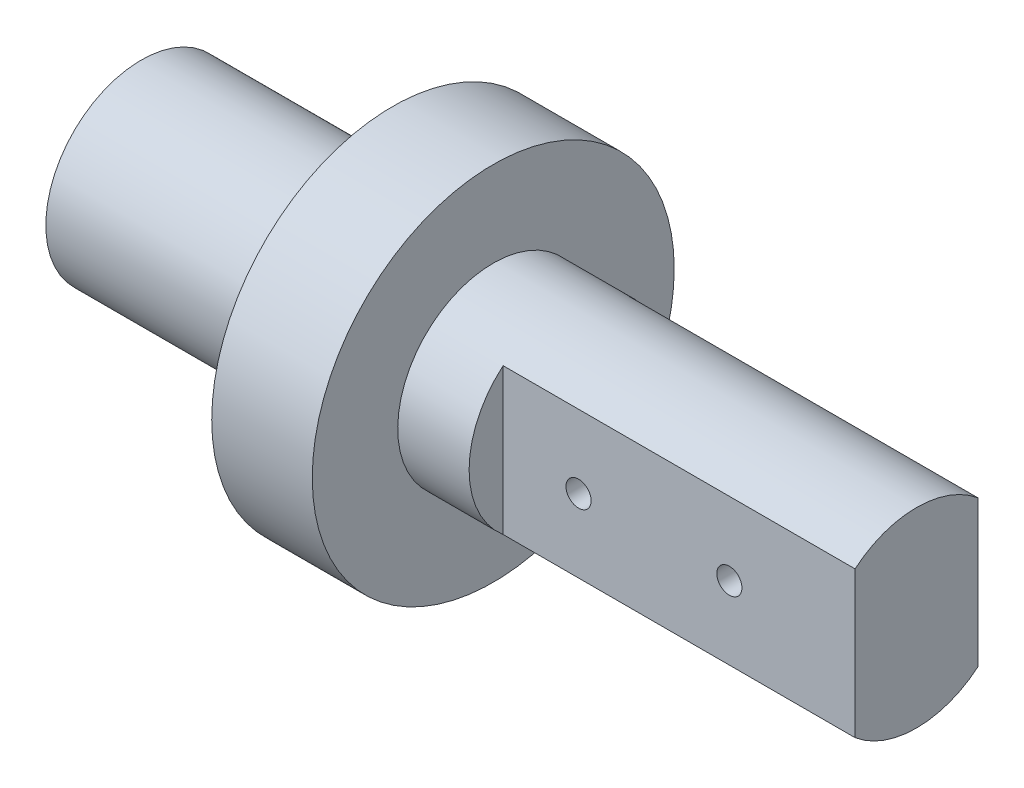
ISO-10303-21;
HEADER;
FILE_DESCRIPTION(('STEP AP214'),'2;1');
FILE_NAME('part.step','',(''),(''),'','','');
FILE_SCHEMA(('AUTOMOTIVE_DESIGN { 1 0 10303 214 1 1 1 1 }'));
ENDSEC;
DATA;
#1=APPLICATION_CONTEXT('core data for automotive mechanical design processes');
#2=APPLICATION_PROTOCOL_DEFINITION('international standard','automotive_design',2000,#1);
#3=PRODUCT_CONTEXT('',#1,'mechanical');
#4=PRODUCT('Part','Part','',(#3));
#5=PRODUCT_RELATED_PRODUCT_CATEGORY('part','',(#4));
#6=PRODUCT_DEFINITION_FORMATION('','',#4);
#7=PRODUCT_DEFINITION_CONTEXT('part definition',#1,'design');
#8=PRODUCT_DEFINITION('design','',#6,#7);
#9=PRODUCT_DEFINITION_SHAPE('','',#8);
#10=(LENGTH_UNIT() NAMED_UNIT(*) SI_UNIT(.MILLI.,.METRE.));
#11=(NAMED_UNIT(*) PLANE_ANGLE_UNIT() SI_UNIT($,.RADIAN.));
#12=(NAMED_UNIT(*) SI_UNIT($,.STERADIAN.) SOLID_ANGLE_UNIT());
#13=UNCERTAINTY_MEASURE_WITH_UNIT(LENGTH_MEASURE(1.E-05),#10,'distance_accuracy_value','');
#14=(GEOMETRIC_REPRESENTATION_CONTEXT(3) GLOBAL_UNCERTAINTY_ASSIGNED_CONTEXT((#13)) GLOBAL_UNIT_ASSIGNED_CONTEXT((#10,
#11,#12)) REPRESENTATION_CONTEXT('',''));
#15=CARTESIAN_POINT('',(0.,0.,0.));
#16=DIRECTION('',(0.,0.,1.));
#17=DIRECTION('',(1.,0.,0.));
#18=AXIS2_PLACEMENT_3D('',#15,#16,#17);
#19=CARTESIAN_POINT('',(0.,0.,0.));
#20=DIRECTION('',(-1.,0.,0.));
#21=DIRECTION('',(0.,0.,1.));
#22=AXIS2_PLACEMENT_3D('',#19,#20,#21);
#23=CYLINDRICAL_SURFACE('',#22,9.5);
#24=CARTESIAN_POINT('',(18.7571862711397,-0.133843323913922,9.49905710924214));
#25=CARTESIAN_POINT('',(18.7497191225898,-0.0644792715354372,9.50003343309708));
#26=CARTESIAN_POINT('',(18.7480669160832,0.00556405323647919,9.50025344602568));
#27=CARTESIAN_POINT('',(18.7564698736311,0.144979561522329,9.4991501404317));
#28=CARTESIAN_POINT('',(18.766536582819,0.214351015191011,9.49782529996253));
#29=CARTESIAN_POINT('',(18.7980796029942,0.350366331225342,9.49378059106666));
#30=CARTESIAN_POINT('',(18.8195490331772,0.417011812445685,9.49106156397555));
#31=CARTESIAN_POINT('',(18.8732622691699,0.545734422655254,9.48453117210074));
#32=CARTESIAN_POINT('',(18.9055043688729,0.607812273138289,9.48071998030071));
#33=CARTESIAN_POINT('',(18.980012367083,0.725964552348348,9.47240745265404));
#34=CARTESIAN_POINT('',(19.0223221240447,0.782011109915849,9.46790312848224));
#35=CARTESIAN_POINT('',(19.1157064001351,0.886240137139336,9.45871669072787));
#36=CARTESIAN_POINT('',(19.1667815153281,0.934422071547889,9.45403456507126));
#37=CARTESIAN_POINT('',(19.276627488953,1.02185619495898,9.44498592507392));
#38=CARTESIAN_POINT('',(19.3354441844691,1.06105105031087,9.44062155209812));
#39=CARTESIAN_POINT('',(19.4588782560648,1.12900411397511,9.43273687670716));
#40=CARTESIAN_POINT('',(19.5234955036514,1.15776255340239,9.42921655560101));
#41=CARTESIAN_POINT('',(19.6564987756165,1.20392977740594,9.42343337261771));
#42=CARTESIAN_POINT('',(19.7248727157887,1.22137287959152,9.4211667117012));
#43=CARTESIAN_POINT('',(19.8636103529643,1.24452529660299,9.41813651838227));
#44=CARTESIAN_POINT('',(19.9339739399041,1.25023525920218,9.41737290299852));
#45=CARTESIAN_POINT('',(20.0741180473625,1.2497517017472,9.41743702976489));
#46=CARTESIAN_POINT('',(20.1438989048636,1.24364904358161,9.41825262474987));
#47=CARTESIAN_POINT('',(20.2814336529233,1.21990371925658,9.42135745067241));
#48=CARTESIAN_POINT('',(20.3491875416964,1.20226104293217,9.42364668290801));
#49=CARTESIAN_POINT('',(20.480743116948,1.15596182651778,9.42943754488172));
#50=CARTESIAN_POINT('',(20.5445458358198,1.12730817768202,9.43293885632892));
#51=CARTESIAN_POINT('',(20.6664552359945,1.05980782384128,9.44076039951871));
#52=CARTESIAN_POINT('',(20.7245616357526,1.02096061536062,9.4450806717081));
#53=CARTESIAN_POINT('',(20.8338984806609,0.933828974038488,9.45409385220929));
#54=CARTESIAN_POINT('',(20.885073778255,0.885475593717308,9.45878932455992));
#55=CARTESIAN_POINT('',(20.9786065215152,0.780866430075416,9.4679986824394));
#56=CARTESIAN_POINT('',(21.0209637465793,0.724610449113877,9.47251256342309));
#57=CARTESIAN_POINT('',(21.0958030235709,0.605539355360445,9.48086976017443));
#58=CARTESIAN_POINT('',(21.1282487731954,0.542701236249752,9.48471058940574));
#59=CARTESIAN_POINT('',(21.1821115457805,0.412408807957424,9.49126803634612));
#60=CARTESIAN_POINT('',(21.203529026196,0.344954690379857,9.49398470068487));
#61=CARTESIAN_POINT('',(21.2346061809182,0.207763032854201,9.49797421108078));
#62=CARTESIAN_POINT('',(21.2443337745644,0.138041124441231,9.4992553944454));
#63=CARTESIAN_POINT('',(21.2519651241998,-0.00205653685352284,9.50025797279816));
#64=CARTESIAN_POINT('',(21.249869366228,-0.0724322627391881,9.49997943190406));
#65=CARTESIAN_POINT('',(21.2339681065827,-0.211383856020531,9.49790067530691));
#66=CARTESIAN_POINT('',(21.2202346292857,-0.279968125199801,9.49610981936629));
#67=CARTESIAN_POINT('',(21.1815597652179,-0.413850068958151,9.49121796297753));
#68=CARTESIAN_POINT('',(21.1566181539444,-0.479147677675186,9.48811693628631));
#69=CARTESIAN_POINT('',(21.096156312494,-0.604829835387539,9.48093661981255));
#70=CARTESIAN_POINT('',(21.0606043437987,-0.665198941952211,9.47685440224967));
#71=CARTESIAN_POINT('',(20.9799543620407,-0.779141796266092,9.46816815868444));
#72=CARTESIAN_POINT('',(20.9348558578671,-0.832715194190853,9.46356410584252));
#73=CARTESIAN_POINT('',(20.8359870238673,-0.931970546159648,9.45430798542196));
#74=CARTESIAN_POINT('',(20.7821536989094,-0.9775897640859,9.44965581802707));
#75=CARTESIAN_POINT('',(20.6675606826757,-1.05915474905901,9.44086222125012));
#76=CARTESIAN_POINT('',(20.6068009758146,-1.09510049433848,9.43672079301734));
#77=CARTESIAN_POINT('',(20.4800260933277,-1.15630060773529,9.42941800330284));
#78=CARTESIAN_POINT('',(20.4140086301521,-1.18155029167616,9.42625707137639));
#79=CARTESIAN_POINT('',(20.2786196091799,-1.22058753162685,9.42128212839032));
#80=CARTESIAN_POINT('',(20.2092482258022,-1.23437568301045,9.41946804736853));
#81=CARTESIAN_POINT('',(20.0696770146042,-1.25001578901799,9.41740533972257));
#82=CARTESIAN_POINT('',(19.9994872830052,-1.25195636866387,9.41714509008395));
#83=CARTESIAN_POINT('',(19.8597839001592,-1.24407956860155,9.4181888493365));
#84=CARTESIAN_POINT('',(19.7902702339264,-1.23426245012179,9.41949282347429));
#85=CARTESIAN_POINT('',(19.6541538459982,-1.20322302888803,9.42350758955671));
#86=CARTESIAN_POINT('',(19.587541324056,-1.1820429706235,9.42621316941837));
#87=CARTESIAN_POINT('',(19.4588147107473,-1.12892288538793,9.43272202907677));
#88=CARTESIAN_POINT('',(19.3967006531188,-1.09698277772767,9.43652531710514));
#89=CARTESIAN_POINT('',(19.2783359388641,-1.02303423463727,9.4448286559659));
#90=CARTESIAN_POINT('',(19.2221213242369,-0.980968558751438,9.4493326146031));
#91=CARTESIAN_POINT('',(19.1175063990004,-0.888032217775664,9.45851856141931));
#92=CARTESIAN_POINT('',(19.0691080485902,-0.837159350584597,9.46320059389391));
#93=CARTESIAN_POINT('',(18.9811880300445,-0.72765848566234,9.47225147965771));
#94=CARTESIAN_POINT('',(18.9417281493417,-0.668980707507695,9.47661801890231));
#95=CARTESIAN_POINT('',(18.8732619564631,-0.545816303637497,9.48450716558606));
#96=CARTESIAN_POINT('',(18.8442446968534,-0.481335850307806,9.48803065552202));
#97=CARTESIAN_POINT('',(18.804886095254,-0.369491516358376,9.49292106017614));
#98=CARTESIAN_POINT('',(18.7915404773749,-0.323175076086507,9.49461755714822));
#99=CARTESIAN_POINT('',(18.7702681725671,-0.229294778749665,9.49734856170854));
#100=CARTESIAN_POINT('',(18.762341446779,-0.181730930632482,9.49838307404391));
#101=CARTESIAN_POINT('',(18.7571862711397,-0.133843323913922,9.49905710924214));
#102=B_SPLINE_CURVE_WITH_KNOTS('',3,(#24,#25,#26,#27,#28,#29,#30,#31,#32,#33,#34,#35,#36,#37,
#38,#39,#40,#41,#42,#43,#44,#45,#46,#47,#48,#49,#50,#51,#52,#53,#54,#55,#56,#57,#58,#59,#60,#61,
#62,#63,#64,#65,#66,#67,#68,#69,#70,#71,#72,#73,#74,#75,#76,#77,#78,#79,#80,#81,#82,#83,#84,#85,
#86,#87,#88,#89,#90,#91,#92,#93,#94,#95,#96,#97,#98,#99,#100,#101),.UNSPECIFIED.,.T.,.F.,(4,2,2,
2,2,2,2,2,2,2,2,2,2,2,2,2,2,2,2,2,2,2,2,2,2,2,2,2,2,2,2,2,2,2,2,2,2,2,4),(0.,0.209139655009107,
0.418485522785862,0.627705207165943,0.836891772359222,1.04700687661839,1.25713627485178,
1.4685710582632,1.68000115915521,1.8907869907077,2.10156118470126,2.31072055855557,
2.51988011664733,2.72898479124065,2.93809979578234,3.14879151172392,3.35948849791804,
3.57094818879147,3.78239910756716,3.9926154431566,4.20282313715398,4.41173930435003,
4.62065965639331,4.83021131987617,5.03977376613028,5.25092086306614,5.46206843512397,
5.67330838067465,5.88453735259802,6.09418428390281,6.30382655743177,6.51269478176198,
6.721564572422,6.93164405516653,7.14177614108067,7.35331922359407,7.56463988619237,
7.70902691413943,7.85341290666598),.UNSPECIFIED.);
#103=CARTESIAN_POINT('',(18.7571862711397,-0.133843323913922,9.49905710924214));
#104=VERTEX_POINT('',#103);
#105=EDGE_CURVE('E12',#104,#104,#102,.T.);
#106=ORIENTED_EDGE('',*,*,#105,.T.);
#107=EDGE_LOOP('',(#106));
#108=FACE_BOUND('',#107,.T.);
#109=CARTESIAN_POINT('',(0.,0.,0.));
#110=DIRECTION('',(1.,0.,0.));
#111=DIRECTION('',(0.,0.,-1.));
#112=AXIS2_PLACEMENT_3D('',#109,#110,#111);
#113=CIRCLE('',#112,9.5);
#114=CARTESIAN_POINT('',(0.,0.,-9.5));
#115=VERTEX_POINT('',#114);
#116=EDGE_CURVE('E173',#115,#115,#113,.F.);
#117=ORIENTED_EDGE('',*,*,#116,.F.);
#118=EDGE_LOOP('',(#117));
#119=FACE_BOUND('',#118,.T.);
#120=CARTESIAN_POINT('',(25.,0.,0.));
#121=DIRECTION('',(1.,0.,0.));
#122=DIRECTION('',(0.,0.,-1.));
#123=AXIS2_PLACEMENT_3D('',#120,#121,#122);
#124=CIRCLE('',#123,9.5);
#125=CARTESIAN_POINT('',(25.,0.,-9.5));
#126=VERTEX_POINT('',#125);
#127=EDGE_CURVE('E50',#126,#126,#124,.T.);
#128=ORIENTED_EDGE('',*,*,#127,.F.);
#129=EDGE_LOOP('',(#128));
#130=FACE_BOUND('',#129,.T.);
#131=ADVANCED_FACE('F46',(#108,#119,#130),#23,.T.);
#132=CARTESIAN_POINT('',(0.,0.,0.));
#133=DIRECTION('',(1.,0.,0.));
#134=DIRECTION('',(0.,0.,-1.));
#135=AXIS2_PLACEMENT_3D('',#132,#133,#134);
#136=PLANE('',#135);
#137=ORIENTED_EDGE('',*,*,#116,.T.);
#138=EDGE_LOOP('',(#137));
#139=FACE_BOUND('',#138,.T.);
#140=ADVANCED_FACE('F209',(#139),#136,.F.);
#141=CARTESIAN_POINT('',(25.,0.,0.));
#142=DIRECTION('',(1.,0.,0.));
#143=DIRECTION('',(0.,0.,-1.));
#144=AXIS2_PLACEMENT_3D('',#141,#142,#143);
#145=CYLINDRICAL_SURFACE('',#144,18.);
#146=CARTESIAN_POINT('',(25.,0.,0.));
#147=DIRECTION('',(1.,0.,0.));
#148=DIRECTION('',(0.,0.,-1.));
#149=AXIS2_PLACEMENT_3D('',#146,#147,#148);
#150=CIRCLE('',#149,18.);
#151=CARTESIAN_POINT('',(25.,0.,-18.));
#152=VERTEX_POINT('',#151);
#153=EDGE_CURVE('E137',#152,#152,#150,.T.);
#154=ORIENTED_EDGE('',*,*,#153,.T.);
#155=EDGE_LOOP('',(#154));
#156=FACE_BOUND('',#155,.T.);
#157=CARTESIAN_POINT('',(35.,0.,0.));
#158=DIRECTION('',(1.,0.,0.));
#159=DIRECTION('',(0.,0.,-1.));
#160=AXIS2_PLACEMENT_3D('',#157,#158,#159);
#161=CIRCLE('',#160,18.);
#162=CARTESIAN_POINT('',(35.,0.,-18.));
#163=VERTEX_POINT('',#162);
#164=EDGE_CURVE('E136',#163,#163,#161,.T.);
#165=ORIENTED_EDGE('',*,*,#164,.F.);
#166=EDGE_LOOP('',(#165));
#167=FACE_BOUND('',#166,.T.);
#168=ADVANCED_FACE('F201',(#156,#167),#145,.T.);
#169=CARTESIAN_POINT('',(25.,0.,0.));
#170=DIRECTION('',(1.,0.,0.));
#171=DIRECTION('',(0.,0.,-1.));
#172=AXIS2_PLACEMENT_3D('',#169,#170,#171);
#173=PLANE('',#172);
#174=ORIENTED_EDGE('',*,*,#127,.T.);
#175=EDGE_LOOP('',(#174));
#176=FACE_BOUND('',#175,.T.);
#177=ORIENTED_EDGE('',*,*,#153,.F.);
#178=EDGE_LOOP('',(#177));
#179=FACE_BOUND('',#178,.T.);
#180=ADVANCED_FACE('F197',(#176,#179),#173,.F.);
#181=CARTESIAN_POINT('',(35.,0.,0.));
#182=DIRECTION('',(1.,0.,0.));
#183=DIRECTION('',(0.,0.,-1.));
#184=AXIS2_PLACEMENT_3D('',#181,#182,#183);
#185=PLANE('',#184);
#186=CARTESIAN_POINT('',(35.,0.,0.));
#187=DIRECTION('',(1.,0.,0.));
#188=DIRECTION('',(0.,0.,-1.));
#189=AXIS2_PLACEMENT_3D('',#186,#187,#188);
#190=CIRCLE('',#189,9.5);
#191=CARTESIAN_POINT('',(35.,0.,-9.5));
#192=VERTEX_POINT('',#191);
#193=EDGE_CURVE('E140',#192,#192,#190,.T.);
#194=ORIENTED_EDGE('',*,*,#193,.F.);
#195=EDGE_LOOP('',(#194));
#196=FACE_BOUND('',#195,.T.);
#197=ORIENTED_EDGE('',*,*,#164,.T.);
#198=EDGE_LOOP('',(#197));
#199=FACE_BOUND('',#198,.T.);
#200=ADVANCED_FACE('F200',(#196,#199),#185,.T.);
#201=CARTESIAN_POINT('',(42.1,10.,0.));
#202=DIRECTION('',(-1.,0.,0.));
#203=DIRECTION('',(0.,0.,1.));
#204=AXIS2_PLACEMENT_3D('',#201,#202,#203);
#205=PLANE('',#204);
#206=DIRECTION('',(0.,1.,0.));
#207=VECTOR('',#206,1.);
#208=CARTESIAN_POINT('',(42.1,10.,-6.11437827766147));
#209=LINE('',#208,#207);
#210=CARTESIAN_POINT('',(42.1,-7.27078938476845,-6.11437827766147));
#211=VERTEX_POINT('',#210);
#212=CARTESIAN_POINT('',(42.1,7.27078938476845,-6.11437827766147));
#213=VERTEX_POINT('',#212);
#214=EDGE_CURVE('E158',#211,#213,#209,.T.);
#215=ORIENTED_EDGE('',*,*,#214,.F.);
#216=CARTESIAN_POINT('',(42.1,0.,0.));
#217=DIRECTION('',(-1.,0.,0.));
#218=DIRECTION('',(0.,0.,1.));
#219=AXIS2_PLACEMENT_3D('',#216,#217,#218);
#220=CIRCLE('',#219,9.5);
#221=EDGE_CURVE('E87',#213,#211,#220,.T.);
#222=ORIENTED_EDGE('',*,*,#221,.F.);
#223=EDGE_LOOP('',(#215,#222));
#224=FACE_BOUND('',#223,.T.);
#225=ADVANCED_FACE('F205',(#224),#205,.F.);
#226=CARTESIAN_POINT('',(72.1,-7.5,-6.11437827766147));
#227=DIRECTION('',(0.,0.,1.));
#228=DIRECTION('',(1.,0.,0.));
#229=AXIS2_PLACEMENT_3D('',#226,#227,#228);
#230=PLANE('',#229);
#231=CARTESIAN_POINT('',(64.6,0.,-6.11437827766147));
#232=DIRECTION('',(0.,0.,1.));
#233=DIRECTION('',(1.,0.,0.));
#234=AXIS2_PLACEMENT_3D('',#231,#232,#233);
#235=CIRCLE('',#234,1.24999999999999);
#236=CARTESIAN_POINT('',(65.85,0.,-6.11437827766147));
#237=VERTEX_POINT('',#236);
#238=EDGE_CURVE('E125',#237,#237,#235,.F.);
#239=ORIENTED_EDGE('',*,*,#238,.F.);
#240=EDGE_LOOP('',(#239));
#241=FACE_BOUND('',#240,.T.);
#242=CARTESIAN_POINT('',(49.6,0.,-6.11437827766147));
#243=DIRECTION('',(0.,0.,1.));
#244=DIRECTION('',(1.,0.,0.));
#245=AXIS2_PLACEMENT_3D('',#242,#243,#244);
#246=CIRCLE('',#245,1.24999999999999);
#247=CARTESIAN_POINT('',(50.85,0.,-6.11437827766147));
#248=VERTEX_POINT('',#247);
#249=EDGE_CURVE('E129',#248,#248,#246,.F.);
#250=ORIENTED_EDGE('',*,*,#249,.F.);
#251=EDGE_LOOP('',(#250));
#252=FACE_BOUND('',#251,.T.);
#253=ORIENTED_EDGE('',*,*,#214,.T.);
#254=DIRECTION('',(-1.,0.,0.));
#255=VECTOR('',#254,1.);
#256=CARTESIAN_POINT('',(77.1,7.27078938476845,-6.11437827766147));
#257=LINE('',#256,#255);
#258=CARTESIAN_POINT('',(77.1,7.27078938476845,-6.11437827766147));
#259=VERTEX_POINT('',#258);
#260=EDGE_CURVE('E146',#259,#213,#257,.T.);
#261=ORIENTED_EDGE('',*,*,#260,.F.);
#262=DIRECTION('',(0.,1.,0.));
#263=VECTOR('',#262,1.);
#264=CARTESIAN_POINT('',(77.1,-7.5,-6.11437827766147));
#265=LINE('',#264,#263);
#266=CARTESIAN_POINT('',(77.1,-7.27078938476845,-6.11437827766147));
#267=VERTEX_POINT('',#266);
#268=EDGE_CURVE('E164',#267,#259,#265,.T.);
#269=ORIENTED_EDGE('',*,*,#268,.F.);
#270=DIRECTION('',(-1.,0.,0.));
#271=VECTOR('',#270,1.);
#272=CARTESIAN_POINT('',(77.1,-7.27078938476845,-6.11437827766147));
#273=LINE('',#272,#271);
#274=EDGE_CURVE('E150',#267,#211,#273,.T.);
#275=ORIENTED_EDGE('',*,*,#274,.T.);
#276=EDGE_LOOP('',(#253,#261,#269,#275));
#277=FACE_BOUND('',#276,.T.);
#278=ADVANCED_FACE('F246',(#241,#252,#277),#230,.F.);
#279=CARTESIAN_POINT('',(72.1,-7.5,6.11437827766147));
#280=DIRECTION('',(0.,0.,-1.));
#281=DIRECTION('',(-1.,0.,0.));
#282=AXIS2_PLACEMENT_3D('',#279,#280,#281);
#283=PLANE('',#282);
#284=CARTESIAN_POINT('',(49.6,0.,6.11437827766147));
#285=DIRECTION('',(0.,0.,-1.));
#286=DIRECTION('',(-1.,0.,0.));
#287=AXIS2_PLACEMENT_3D('',#284,#285,#286);
#288=CIRCLE('',#287,1.24999999999999);
#289=CARTESIAN_POINT('',(48.35,0.,6.11437827766147));
#290=VERTEX_POINT('',#289);
#291=EDGE_CURVE('E114',#290,#290,#288,.F.);
#292=ORIENTED_EDGE('',*,*,#291,.F.);
#293=EDGE_LOOP('',(#292));
#294=FACE_BOUND('',#293,.T.);
#295=CARTESIAN_POINT('',(64.6,0.,6.11437827766147));
#296=DIRECTION('',(0.,0.,-1.));
#297=DIRECTION('',(-1.,0.,0.));
#298=AXIS2_PLACEMENT_3D('',#295,#296,#297);
#299=CIRCLE('',#298,1.24999999999999);
#300=CARTESIAN_POINT('',(63.35,0.,6.11437827766147));
#301=VERTEX_POINT('',#300);
#302=EDGE_CURVE('E113',#301,#301,#299,.F.);
#303=ORIENTED_EDGE('',*,*,#302,.F.);
#304=EDGE_LOOP('',(#303));
#305=FACE_BOUND('',#304,.T.);
#306=DIRECTION('',(0.,-1.,0.));
#307=VECTOR('',#306,1.);
#308=CARTESIAN_POINT('',(42.1,10.,6.11437827766147));
#309=LINE('',#308,#307);
#310=CARTESIAN_POINT('',(42.1,7.27078938476845,6.11437827766147));
#311=VERTEX_POINT('',#310);
#312=CARTESIAN_POINT('',(42.1,-7.27078938476845,6.11437827766147));
#313=VERTEX_POINT('',#312);
#314=EDGE_CURVE('E155',#311,#313,#309,.T.);
#315=ORIENTED_EDGE('',*,*,#314,.T.);
#316=DIRECTION('',(-1.,0.,0.));
#317=VECTOR('',#316,1.);
#318=CARTESIAN_POINT('',(77.1,-7.27078938476845,6.11437827766147));
#319=LINE('',#318,#317);
#320=CARTESIAN_POINT('',(77.1,-7.27078938476845,6.11437827766147));
#321=VERTEX_POINT('',#320);
#322=EDGE_CURVE('E147',#321,#313,#319,.T.);
#323=ORIENTED_EDGE('',*,*,#322,.F.);
#324=DIRECTION('',(0.,-1.,0.));
#325=VECTOR('',#324,1.);
#326=CARTESIAN_POINT('',(77.1,-7.5,6.11437827766147));
#327=LINE('',#326,#325);
#328=CARTESIAN_POINT('',(77.1,7.27078938476845,6.11437827766147));
#329=VERTEX_POINT('',#328);
#330=EDGE_CURVE('E120',#329,#321,#327,.T.);
#331=ORIENTED_EDGE('',*,*,#330,.F.);
#332=DIRECTION('',(-1.,0.,0.));
#333=VECTOR('',#332,1.);
#334=CARTESIAN_POINT('',(77.1,7.27078938476845,6.11437827766147));
#335=LINE('',#334,#333);
#336=EDGE_CURVE('E143',#329,#311,#335,.T.);
#337=ORIENTED_EDGE('',*,*,#336,.T.);
#338=EDGE_LOOP('',(#315,#323,#331,#337));
#339=FACE_BOUND('',#338,.T.);
#340=ADVANCED_FACE('F48',(#294,#305,#339),#283,.F.);
#341=ORIENTED_EDGE('',*,*,#314,.F.);
#342=CARTESIAN_POINT('',(42.1,0.,0.));
#343=DIRECTION('',(-1.,0.,0.));
#344=DIRECTION('',(0.,0.,1.));
#345=AXIS2_PLACEMENT_3D('',#342,#343,#344);
#346=CIRCLE('',#345,9.5);
#347=EDGE_CURVE('E62',#313,#311,#346,.T.);
#348=ORIENTED_EDGE('',*,*,#347,.F.);
#349=EDGE_LOOP('',(#341,#348));
#350=FACE_BOUND('',#349,.T.);
#351=ADVANCED_FACE('F211',(#350),#205,.F.);
#352=ORIENTED_EDGE('',*,*,#193,.T.);
#353=EDGE_LOOP('',(#352));
#354=FACE_BOUND('',#353,.T.);
#355=ORIENTED_EDGE('',*,*,#347,.T.);
#356=ORIENTED_EDGE('',*,*,#336,.F.);
#357=CARTESIAN_POINT('',(77.1,0.,0.));
#358=DIRECTION('',(1.,0.,0.));
#359=DIRECTION('',(0.,0.,-1.));
#360=AXIS2_PLACEMENT_3D('',#357,#358,#359);
#361=CIRCLE('',#360,9.5);
#362=EDGE_CURVE('E161',#259,#329,#361,.T.);
#363=ORIENTED_EDGE('',*,*,#362,.F.);
#364=ORIENTED_EDGE('',*,*,#260,.T.);
#365=ORIENTED_EDGE('',*,*,#221,.T.);
#366=ORIENTED_EDGE('',*,*,#274,.F.);
#367=CARTESIAN_POINT('',(77.1,0.,0.));
#368=DIRECTION('',(1.,0.,0.));
#369=DIRECTION('',(0.,0.,-1.));
#370=AXIS2_PLACEMENT_3D('',#367,#368,#369);
#371=CIRCLE('',#370,9.5);
#372=EDGE_CURVE('E167',#321,#267,#371,.T.);
#373=ORIENTED_EDGE('',*,*,#372,.F.);
#374=ORIENTED_EDGE('',*,*,#322,.T.);
#375=EDGE_LOOP('',(#355,#356,#363,#364,#365,#366,#373,#374));
#376=FACE_BOUND('',#375,.T.);
#377=ADVANCED_FACE('F183',(#354,#376),#23,.T.);
#378=CARTESIAN_POINT('',(20.,0.,10.));
#379=DIRECTION('',(0.,0.,1.));
#380=DIRECTION('',(1.,0.,0.));
#381=AXIS2_PLACEMENT_3D('',#378,#379,#380);
#382=CYLINDRICAL_SURFACE('',#381,1.24999999999999);
#383=CARTESIAN_POINT('',(20.,0.,0.));
#384=DIRECTION('',(0.,0.,1.));
#385=DIRECTION('',(1.,0.,0.));
#386=AXIS2_PLACEMENT_3D('',#383,#384,#385);
#387=CIRCLE('',#386,1.25);
#388=CARTESIAN_POINT('',(21.25,0.,0.));
#389=VERTEX_POINT('',#388);
#390=EDGE_CURVE('E133',#389,#389,#387,.T.);
#391=ORIENTED_EDGE('',*,*,#390,.F.);
#392=EDGE_LOOP('',(#391));
#393=FACE_BOUND('',#392,.T.);
#394=ORIENTED_EDGE('',*,*,#105,.F.);
#395=EDGE_LOOP('',(#394));
#396=FACE_BOUND('',#395,.T.);
#397=ADVANCED_FACE('F186',(#393,#396),#382,.F.);
#398=CARTESIAN_POINT('',(20.,0.,0.));
#399=DIRECTION('',(0.,0.,1.));
#400=DIRECTION('',(1.,0.,0.));
#401=AXIS2_PLACEMENT_3D('',#398,#399,#400);
#402=CONICAL_SURFACE('',#401,1.25,1.02974425867665);
#403=CARTESIAN_POINT('',(20.,0.,-0.751075773784452));
#404=VERTEX_POINT('',#403);
#405=VERTEX_LOOP('',#404);
#406=FACE_BOUND('',#405,.T.);
#407=ORIENTED_EDGE('',*,*,#390,.T.);
#408=EDGE_LOOP('',(#407));
#409=FACE_BOUND('',#408,.T.);
#410=ADVANCED_FACE('F191',(#406,#409),#402,.F.);
#411=CARTESIAN_POINT('',(49.6,0.,-1.61437827766148));
#412=DIRECTION('',(0.,0.,-1.));
#413=DIRECTION('',(-1.,0.,0.));
#414=AXIS2_PLACEMENT_3D('',#411,#412,#413);
#415=CONICAL_SURFACE('',#414,1.25,1.02974425867665);
#416=CARTESIAN_POINT('',(49.6,0.,-0.863302503877024));
#417=VERTEX_POINT('',#416);
#418=VERTEX_LOOP('',#417);
#419=FACE_BOUND('',#418,.T.);
#420=CARTESIAN_POINT('',(49.6,0.,-1.61437827766148));
#421=DIRECTION('',(0.,0.,-1.));
#422=DIRECTION('',(-1.,0.,0.));
#423=AXIS2_PLACEMENT_3D('',#420,#421,#422);
#424=CIRCLE('',#423,1.25);
#425=CARTESIAN_POINT('',(48.35,0.,-1.61437827766148));
#426=VERTEX_POINT('',#425);
#427=EDGE_CURVE('E130',#426,#426,#424,.T.);
#428=ORIENTED_EDGE('',*,*,#427,.T.);
#429=EDGE_LOOP('',(#428));
#430=FACE_BOUND('',#429,.T.);
#431=ADVANCED_FACE('F193',(#419,#430),#415,.F.);
#432=CARTESIAN_POINT('',(49.6,0.,-6.61437827766147));
#433=DIRECTION('',(0.,0.,-1.));
#434=DIRECTION('',(-1.,0.,0.));
#435=AXIS2_PLACEMENT_3D('',#432,#433,#434);
#436=CYLINDRICAL_SURFACE('',#435,1.24999999999999);
#437=ORIENTED_EDGE('',*,*,#427,.F.);
#438=EDGE_LOOP('',(#437));
#439=FACE_BOUND('',#438,.T.);
#440=ORIENTED_EDGE('',*,*,#249,.T.);
#441=EDGE_LOOP('',(#440));
#442=FACE_BOUND('',#441,.T.);
#443=ADVANCED_FACE('F260',(#439,#442),#436,.F.);
#444=CARTESIAN_POINT('',(64.6,0.,-1.61437827766148));
#445=DIRECTION('',(0.,0.,-1.));
#446=DIRECTION('',(-1.,0.,0.));
#447=AXIS2_PLACEMENT_3D('',#444,#445,#446);
#448=CONICAL_SURFACE('',#447,1.25,1.02974425867665);
#449=CARTESIAN_POINT('',(64.6,0.,-0.863302503877024));
#450=VERTEX_POINT('',#449);
#451=VERTEX_LOOP('',#450);
#452=FACE_BOUND('',#451,.T.);
#453=CARTESIAN_POINT('',(64.6,0.,-1.61437827766148));
#454=DIRECTION('',(0.,0.,-1.));
#455=DIRECTION('',(-1.,0.,0.));
#456=AXIS2_PLACEMENT_3D('',#453,#454,#455);
#457=CIRCLE('',#456,1.25);
#458=CARTESIAN_POINT('',(63.35,0.,-1.61437827766148));
#459=VERTEX_POINT('',#458);
#460=EDGE_CURVE('E126',#459,#459,#457,.T.);
#461=ORIENTED_EDGE('',*,*,#460,.T.);
#462=EDGE_LOOP('',(#461));
#463=FACE_BOUND('',#462,.T.);
#464=ADVANCED_FACE('F262',(#452,#463),#448,.F.);
#465=CARTESIAN_POINT('',(64.6,0.,-6.61437827766147));
#466=DIRECTION('',(0.,0.,-1.));
#467=DIRECTION('',(-1.,0.,0.));
#468=AXIS2_PLACEMENT_3D('',#465,#466,#467);
#469=CYLINDRICAL_SURFACE('',#468,1.24999999999999);
#470=ORIENTED_EDGE('',*,*,#460,.F.);
#471=EDGE_LOOP('',(#470));
#472=FACE_BOUND('',#471,.T.);
#473=ORIENTED_EDGE('',*,*,#238,.T.);
#474=EDGE_LOOP('',(#473));
#475=FACE_BOUND('',#474,.T.);
#476=ADVANCED_FACE('F268',(#472,#475),#469,.F.);
#477=CARTESIAN_POINT('',(64.6,0.,1.61437827766148));
#478=DIRECTION('',(0.,0.,1.));
#479=DIRECTION('',(1.,0.,0.));
#480=AXIS2_PLACEMENT_3D('',#477,#478,#479);
#481=CONICAL_SURFACE('',#480,1.25,1.02974425867665);
#482=CARTESIAN_POINT('',(64.6,0.,0.863302503877026));
#483=VERTEX_POINT('',#482);
#484=VERTEX_LOOP('',#483);
#485=FACE_BOUND('',#484,.T.);
#486=CARTESIAN_POINT('',(64.6,0.,1.61437827766148));
#487=DIRECTION('',(0.,0.,1.));
#488=DIRECTION('',(1.,0.,0.));
#489=AXIS2_PLACEMENT_3D('',#486,#487,#488);
#490=CIRCLE('',#489,1.25);
#491=CARTESIAN_POINT('',(65.85,0.,1.61437827766148));
#492=VERTEX_POINT('',#491);
#493=EDGE_CURVE('E117',#492,#492,#490,.T.);
#494=ORIENTED_EDGE('',*,*,#493,.T.);
#495=EDGE_LOOP('',(#494));
#496=FACE_BOUND('',#495,.T.);
#497=ADVANCED_FACE('F275',(#485,#496),#481,.F.);
#498=CARTESIAN_POINT('',(64.6,0.,6.61437827766148));
#499=DIRECTION('',(0.,0.,1.));
#500=DIRECTION('',(1.,0.,0.));
#501=AXIS2_PLACEMENT_3D('',#498,#499,#500);
#502=CYLINDRICAL_SURFACE('',#501,1.24999999999999);
#503=ORIENTED_EDGE('',*,*,#493,.F.);
#504=EDGE_LOOP('',(#503));
#505=FACE_BOUND('',#504,.T.);
#506=ORIENTED_EDGE('',*,*,#302,.T.);
#507=EDGE_LOOP('',(#506));
#508=FACE_BOUND('',#507,.T.);
#509=ADVANCED_FACE('F107',(#505,#508),#502,.F.);
#510=CARTESIAN_POINT('',(49.6,0.,1.61437827766148));
#511=DIRECTION('',(0.,0.,1.));
#512=DIRECTION('',(1.,0.,0.));
#513=AXIS2_PLACEMENT_3D('',#510,#511,#512);
#514=CONICAL_SURFACE('',#513,1.25,1.02974425867665);
#515=CARTESIAN_POINT('',(49.6,0.,0.863302503877024));
#516=VERTEX_POINT('',#515);
#517=VERTEX_LOOP('',#516);
#518=FACE_BOUND('',#517,.T.);
#519=CARTESIAN_POINT('',(49.6,0.,1.61437827766148));
#520=DIRECTION('',(0.,0.,1.));
#521=DIRECTION('',(1.,0.,0.));
#522=AXIS2_PLACEMENT_3D('',#519,#520,#521);
#523=CIRCLE('',#522,1.25);
#524=CARTESIAN_POINT('',(50.85,0.,1.61437827766148));
#525=VERTEX_POINT('',#524);
#526=EDGE_CURVE('E111',#525,#525,#523,.T.);
#527=ORIENTED_EDGE('',*,*,#526,.T.);
#528=EDGE_LOOP('',(#527));
#529=FACE_BOUND('',#528,.T.);
#530=ADVANCED_FACE('F103',(#518,#529),#514,.F.);
#531=CARTESIAN_POINT('',(49.6,0.,6.61437827766147));
#532=DIRECTION('',(0.,0.,1.));
#533=DIRECTION('',(1.,0.,0.));
#534=AXIS2_PLACEMENT_3D('',#531,#532,#533);
#535=CYLINDRICAL_SURFACE('',#534,1.24999999999999);
#536=ORIENTED_EDGE('',*,*,#526,.F.);
#537=EDGE_LOOP('',(#536));
#538=FACE_BOUND('',#537,.T.);
#539=ORIENTED_EDGE('',*,*,#291,.T.);
#540=EDGE_LOOP('',(#539));
#541=FACE_BOUND('',#540,.T.);
#542=ADVANCED_FACE('F106',(#538,#541),#535,.F.);
#543=CARTESIAN_POINT('',(77.1,0.,0.));
#544=DIRECTION('',(1.,0.,0.));
#545=DIRECTION('',(0.,0.,-1.));
#546=AXIS2_PLACEMENT_3D('',#543,#544,#545);
#547=PLANE('',#546);
#548=ORIENTED_EDGE('',*,*,#372,.T.);
#549=ORIENTED_EDGE('',*,*,#268,.T.);
#550=ORIENTED_EDGE('',*,*,#362,.T.);
#551=ORIENTED_EDGE('',*,*,#330,.T.);
#552=EDGE_LOOP('',(#548,#549,#550,#551));
#553=FACE_BOUND('',#552,.T.);
#554=ADVANCED_FACE('F243',(#553),#547,.T.);
#555=CLOSED_SHELL('',(#131,#140,#168,#180,#200,#225,#278,#340,#351,#377,#397,#410,#431,#443,
#464,#476,#497,#509,#530,#542,#554));
#556=MANIFOLD_SOLID_BREP('B2',#555);
#557=ADVANCED_BREP_SHAPE_REPRESENTATION('',(#18,#556),#14);
#558=SHAPE_DEFINITION_REPRESENTATION(#9,#557);
ENDSEC;
END-ISO-10303-21;
